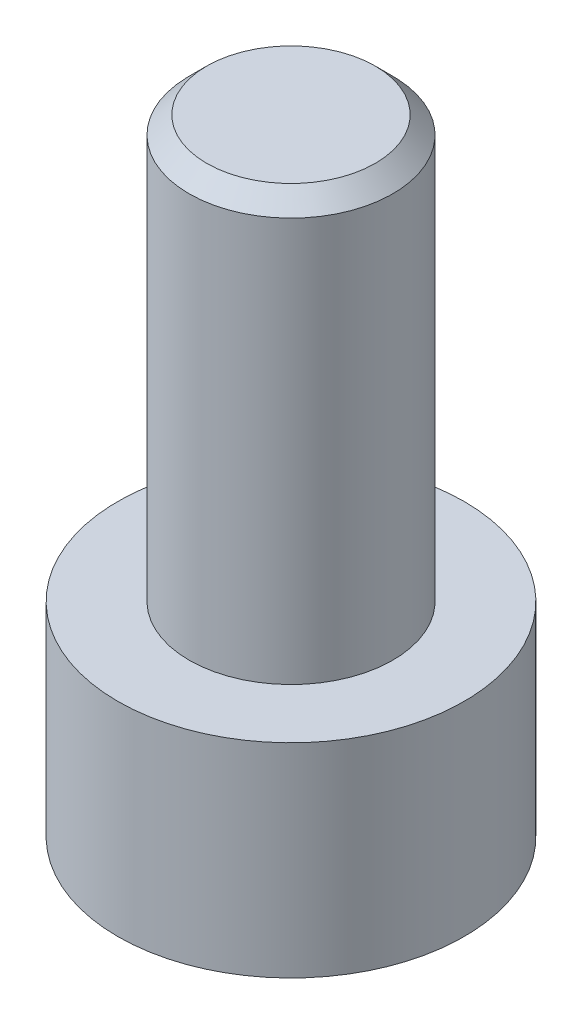
ISO-10303-21;
HEADER;
FILE_DESCRIPTION(('STEP AP214'),'2;1');
FILE_NAME('part.step','',(''),(''),'','','');
FILE_SCHEMA(('AUTOMOTIVE_DESIGN { 1 0 10303 214 1 1 1 1 }'));
ENDSEC;
DATA;
#1=APPLICATION_CONTEXT('core data for automotive mechanical design processes');
#2=APPLICATION_PROTOCOL_DEFINITION('international standard','automotive_design',2000,#1);
#3=PRODUCT_CONTEXT('',#1,'mechanical');
#4=PRODUCT('Part','Part','',(#3));
#5=PRODUCT_RELATED_PRODUCT_CATEGORY('part','',(#4));
#6=PRODUCT_DEFINITION_FORMATION('','',#4);
#7=PRODUCT_DEFINITION_CONTEXT('part definition',#1,'design');
#8=PRODUCT_DEFINITION('design','',#6,#7);
#9=PRODUCT_DEFINITION_SHAPE('','',#8);
#10=(LENGTH_UNIT() NAMED_UNIT(*) SI_UNIT(.MILLI.,.METRE.));
#11=(NAMED_UNIT(*) PLANE_ANGLE_UNIT() SI_UNIT($,.RADIAN.));
#12=(NAMED_UNIT(*) SI_UNIT($,.STERADIAN.) SOLID_ANGLE_UNIT());
#13=UNCERTAINTY_MEASURE_WITH_UNIT(LENGTH_MEASURE(1.E-05),#10,'distance_accuracy_value','');
#14=(GEOMETRIC_REPRESENTATION_CONTEXT(3) GLOBAL_UNCERTAINTY_ASSIGNED_CONTEXT((#13)) GLOBAL_UNIT_ASSIGNED_CONTEXT((#10,
#11,#12)) REPRESENTATION_CONTEXT('',''));
#15=CARTESIAN_POINT('',(0.,0.,0.));
#16=DIRECTION('',(0.,0.,1.));
#17=DIRECTION('',(1.,0.,0.));
#18=AXIS2_PLACEMENT_3D('',#15,#16,#17);
#19=CARTESIAN_POINT('',(0.,2.9,0.));
#20=DIRECTION('',(0.,-1.,0.));
#21=DIRECTION('',(0.,0.,-1.));
#22=AXIS2_PLACEMENT_3D('',#19,#20,#21);
#23=CYLINDRICAL_SURFACE('',#22,2.465);
#24=CARTESIAN_POINT('',(0.,2.9,0.));
#25=DIRECTION('',(0.,1.,0.));
#26=DIRECTION('',(0.,0.,1.));
#27=AXIS2_PLACEMENT_3D('',#24,#25,#26);
#28=CIRCLE('',#27,2.465);
#29=CARTESIAN_POINT('',(0.,2.9,2.465));
#30=VERTEX_POINT('',#29);
#31=EDGE_CURVE('E177',#30,#30,#28,.T.);
#32=ORIENTED_EDGE('',*,*,#31,.F.);
#33=EDGE_LOOP('',(#32));
#34=FACE_BOUND('',#33,.T.);
#35=CARTESIAN_POINT('',(0.,0.,0.));
#36=DIRECTION('',(0.,1.,0.));
#37=DIRECTION('',(0.,0.,1.));
#38=AXIS2_PLACEMENT_3D('',#35,#36,#37);
#39=CIRCLE('',#38,2.465);
#40=CARTESIAN_POINT('',(0.,0.,2.465));
#41=VERTEX_POINT('',#40);
#42=EDGE_CURVE('E163',#41,#41,#39,.T.);
#43=ORIENTED_EDGE('',*,*,#42,.T.);
#44=EDGE_LOOP('',(#43));
#45=FACE_BOUND('',#44,.T.);
#46=ADVANCED_FACE('F47',(#34,#45),#23,.T.);
#47=CARTESIAN_POINT('',(0.,2.9,0.));
#48=DIRECTION('',(0.,1.,0.));
#49=DIRECTION('',(0.,0.,1.));
#50=AXIS2_PLACEMENT_3D('',#47,#48,#49);
#51=PLANE('',#50);
#52=CARTESIAN_POINT('',(0.,2.9,0.));
#53=DIRECTION('',(0.,1.,0.));
#54=DIRECTION('',(0.,0.,1.));
#55=AXIS2_PLACEMENT_3D('',#52,#53,#54);
#56=CIRCLE('',#55,1.45);
#57=CARTESIAN_POINT('',(0.,2.9,1.45));
#58=VERTEX_POINT('',#57);
#59=EDGE_CURVE('E173',#58,#58,#56,.T.);
#60=ORIENTED_EDGE('',*,*,#59,.F.);
#61=EDGE_LOOP('',(#60));
#62=FACE_BOUND('',#61,.T.);
#63=ORIENTED_EDGE('',*,*,#31,.T.);
#64=EDGE_LOOP('',(#63));
#65=FACE_BOUND('',#64,.T.);
#66=ADVANCED_FACE('F199',(#62,#65),#51,.T.);
#67=CARTESIAN_POINT('',(0.,0.,0.));
#68=DIRECTION('',(0.,1.,0.));
#69=DIRECTION('',(0.,0.,1.));
#70=AXIS2_PLACEMENT_3D('',#67,#68,#69);
#71=PLANE('',#70);
#72=DIRECTION('',(0.5,0.,0.866025403784439));
#73=VECTOR('',#72,1.);
#74=CARTESIAN_POINT('',(0.733234841870825,0.,-1.27));
#75=LINE('',#74,#73);
#76=CARTESIAN_POINT('',(0.733234841870825,0.,-1.27));
#77=VERTEX_POINT('',#76);
#78=CARTESIAN_POINT('',(1.46646968374165,0.,0.));
#79=VERTEX_POINT('',#78);
#80=EDGE_CURVE('E144',#77,#79,#75,.T.);
#81=ORIENTED_EDGE('',*,*,#80,.F.);
#82=DIRECTION('',(1.,0.,0.));
#83=VECTOR('',#82,1.);
#84=CARTESIAN_POINT('',(-0.733234841870825,0.,-1.27));
#85=LINE('',#84,#83);
#86=CARTESIAN_POINT('',(-0.733234841870825,0.,-1.27));
#87=VERTEX_POINT('',#86);
#88=EDGE_CURVE('E64',#87,#77,#85,.T.);
#89=ORIENTED_EDGE('',*,*,#88,.F.);
#90=DIRECTION('',(0.5,0.,-0.866025403784438));
#91=VECTOR('',#90,1.);
#92=CARTESIAN_POINT('',(-1.46646968374165,0.,0.));
#93=LINE('',#92,#91);
#94=CARTESIAN_POINT('',(-1.46646968374165,0.,0.));
#95=VERTEX_POINT('',#94);
#96=EDGE_CURVE('E157',#95,#87,#93,.T.);
#97=ORIENTED_EDGE('',*,*,#96,.F.);
#98=DIRECTION('',(-0.5,0.,-0.866025403784439));
#99=VECTOR('',#98,1.);
#100=CARTESIAN_POINT('',(-0.733234841870825,0.,1.27));
#101=LINE('',#100,#99);
#102=CARTESIAN_POINT('',(-0.733234841870825,0.,1.27));
#103=VERTEX_POINT('',#102);
#104=EDGE_CURVE('E154',#103,#95,#101,.T.);
#105=ORIENTED_EDGE('',*,*,#104,.F.);
#106=DIRECTION('',(-1.,0.,0.));
#107=VECTOR('',#106,1.);
#108=CARTESIAN_POINT('',(0.733234841870825,0.,1.27));
#109=LINE('',#108,#107);
#110=CARTESIAN_POINT('',(0.733234841870825,0.,1.27));
#111=VERTEX_POINT('',#110);
#112=EDGE_CURVE('E112',#111,#103,#109,.T.);
#113=ORIENTED_EDGE('',*,*,#112,.F.);
#114=DIRECTION('',(-0.5,0.,0.866025403784439));
#115=VECTOR('',#114,1.);
#116=CARTESIAN_POINT('',(1.46646968374165,0.,0.));
#117=LINE('',#116,#115);
#118=EDGE_CURVE('E148',#79,#111,#117,.T.);
#119=ORIENTED_EDGE('',*,*,#118,.F.);
#120=EDGE_LOOP('',(#81,#89,#97,#105,#113,#119));
#121=FACE_BOUND('',#120,.T.);
#122=ORIENTED_EDGE('',*,*,#42,.F.);
#123=EDGE_LOOP('',(#122));
#124=FACE_BOUND('',#123,.T.);
#125=ADVANCED_FACE('F204',(#121,#124),#71,.F.);
#126=CARTESIAN_POINT('',(0.,8.9,0.));
#127=DIRECTION('',(0.,-1.,0.));
#128=DIRECTION('',(0.,0.,-1.));
#129=AXIS2_PLACEMENT_3D('',#126,#127,#128);
#130=CYLINDRICAL_SURFACE('',#129,1.45);
#131=CARTESIAN_POINT('',(0.,8.65,0.));
#132=DIRECTION('',(0.,1.,0.));
#133=DIRECTION('',(0.,0.,1.));
#134=AXIS2_PLACEMENT_3D('',#131,#132,#133);
#135=CIRCLE('',#134,1.45);
#136=CARTESIAN_POINT('',(0.,8.65,1.45));
#137=VERTEX_POINT('',#136);
#138=EDGE_CURVE('E11',#137,#137,#135,.F.);
#139=ORIENTED_EDGE('',*,*,#138,.T.);
#140=EDGE_LOOP('',(#139));
#141=FACE_BOUND('',#140,.T.);
#142=ORIENTED_EDGE('',*,*,#59,.T.);
#143=EDGE_LOOP('',(#142));
#144=FACE_BOUND('',#143,.T.);
#145=ADVANCED_FACE('F211',(#141,#144),#130,.T.);
#146=CARTESIAN_POINT('',(0.,8.9,0.));
#147=DIRECTION('',(0.,1.,0.));
#148=DIRECTION('',(0.,0.,1.));
#149=AXIS2_PLACEMENT_3D('',#146,#147,#148);
#150=PLANE('',#149);
#151=CARTESIAN_POINT('',(0.,8.9,0.));
#152=DIRECTION('',(0.,1.,0.));
#153=DIRECTION('',(0.,0.,1.));
#154=AXIS2_PLACEMENT_3D('',#151,#152,#153);
#155=CIRCLE('',#154,1.2);
#156=CARTESIAN_POINT('',(0.,8.9,1.2));
#157=VERTEX_POINT('',#156);
#158=EDGE_CURVE('E57',#157,#157,#155,.T.);
#159=ORIENTED_EDGE('',*,*,#158,.T.);
#160=EDGE_LOOP('',(#159));
#161=FACE_BOUND('',#160,.T.);
#162=ADVANCED_FACE('F187',(#161),#150,.T.);
#163=CARTESIAN_POINT('',(-0.733234841870825,1.9,-1.27));
#164=DIRECTION('',(0.,0.,-1.));
#165=DIRECTION('',(-1.,0.,0.));
#166=AXIS2_PLACEMENT_3D('',#163,#164,#165);
#167=PLANE('',#166);
#168=ORIENTED_EDGE('',*,*,#88,.T.);
#169=DIRECTION('',(0.,-1.,0.));
#170=VECTOR('',#169,1.);
#171=CARTESIAN_POINT('',(0.733234841870825,1.9,-1.27));
#172=LINE('',#171,#170);
#173=CARTESIAN_POINT('',(0.733234841870825,1.9,-1.27));
#174=VERTEX_POINT('',#173);
#175=EDGE_CURVE('E94',#174,#77,#172,.T.);
#176=ORIENTED_EDGE('',*,*,#175,.F.);
#177=DIRECTION('',(1.,0.,0.));
#178=VECTOR('',#177,1.);
#179=CARTESIAN_POINT('',(-0.733234841870825,1.9,-1.27));
#180=LINE('',#179,#178);
#181=CARTESIAN_POINT('',(-0.733234841870825,1.9,-1.27));
#182=VERTEX_POINT('',#181);
#183=EDGE_CURVE('E160',#182,#174,#180,.T.);
#184=ORIENTED_EDGE('',*,*,#183,.F.);
#185=DIRECTION('',(0.,-1.,0.));
#186=VECTOR('',#185,1.);
#187=CARTESIAN_POINT('',(-0.733234841870825,1.9,-1.27));
#188=LINE('',#187,#186);
#189=EDGE_CURVE('E72',#182,#87,#188,.T.);
#190=ORIENTED_EDGE('',*,*,#189,.T.);
#191=EDGE_LOOP('',(#168,#176,#184,#190));
#192=FACE_BOUND('',#191,.T.);
#193=ADVANCED_FACE('F218',(#192),#167,.F.);
#194=CARTESIAN_POINT('',(-1.46646968374165,1.9,0.));
#195=DIRECTION('',(-0.866025403784439,0.,-0.5));
#196=DIRECTION('',(-0.5,0.,0.866025403784439));
#197=AXIS2_PLACEMENT_3D('',#194,#195,#196);
#198=PLANE('',#197);
#199=ORIENTED_EDGE('',*,*,#96,.T.);
#200=ORIENTED_EDGE('',*,*,#189,.F.);
#201=DIRECTION('',(0.5,0.,-0.866025403784438));
#202=VECTOR('',#201,1.);
#203=CARTESIAN_POINT('',(-1.46646968374165,1.9,0.));
#204=LINE('',#203,#202);
#205=CARTESIAN_POINT('',(-1.46646968374165,1.9,0.));
#206=VERTEX_POINT('',#205);
#207=EDGE_CURVE('E126',#206,#182,#204,.T.);
#208=ORIENTED_EDGE('',*,*,#207,.F.);
#209=DIRECTION('',(0.,-1.,0.));
#210=VECTOR('',#209,1.);
#211=CARTESIAN_POINT('',(-1.46646968374165,1.9,0.));
#212=LINE('',#211,#210);
#213=EDGE_CURVE('E117',#206,#95,#212,.T.);
#214=ORIENTED_EDGE('',*,*,#213,.T.);
#215=EDGE_LOOP('',(#199,#200,#208,#214));
#216=FACE_BOUND('',#215,.T.);
#217=ADVANCED_FACE('F221',(#216),#198,.F.);
#218=CARTESIAN_POINT('',(-0.733234841870825,1.9,1.27));
#219=DIRECTION('',(-0.866025403784438,0.,0.5));
#220=DIRECTION('',(0.5,0.,0.866025403784439));
#221=AXIS2_PLACEMENT_3D('',#218,#219,#220);
#222=PLANE('',#221);
#223=ORIENTED_EDGE('',*,*,#104,.T.);
#224=ORIENTED_EDGE('',*,*,#213,.F.);
#225=DIRECTION('',(-0.5,0.,-0.866025403784439));
#226=VECTOR('',#225,1.);
#227=CARTESIAN_POINT('',(-0.733234841870825,1.9,1.27));
#228=LINE('',#227,#226);
#229=CARTESIAN_POINT('',(-0.733234841870825,1.9,1.27));
#230=VERTEX_POINT('',#229);
#231=EDGE_CURVE('E121',#230,#206,#228,.T.);
#232=ORIENTED_EDGE('',*,*,#231,.F.);
#233=DIRECTION('',(0.,-1.,0.));
#234=VECTOR('',#233,1.);
#235=CARTESIAN_POINT('',(-0.733234841870825,1.9,1.27));
#236=LINE('',#235,#234);
#237=EDGE_CURVE('E105',#230,#103,#236,.T.);
#238=ORIENTED_EDGE('',*,*,#237,.T.);
#239=EDGE_LOOP('',(#223,#224,#232,#238));
#240=FACE_BOUND('',#239,.T.);
#241=ADVANCED_FACE('F122',(#240),#222,.F.);
#242=CARTESIAN_POINT('',(0.733234841870825,1.9,1.27));
#243=DIRECTION('',(0.,0.,1.));
#244=DIRECTION('',(1.,0.,0.));
#245=AXIS2_PLACEMENT_3D('',#242,#243,#244);
#246=PLANE('',#245);
#247=ORIENTED_EDGE('',*,*,#112,.T.);
#248=ORIENTED_EDGE('',*,*,#237,.F.);
#249=DIRECTION('',(-1.,0.,0.));
#250=VECTOR('',#249,1.);
#251=CARTESIAN_POINT('',(0.733234841870825,1.9,1.27));
#252=LINE('',#251,#250);
#253=CARTESIAN_POINT('',(0.733234841870825,1.9,1.27));
#254=VERTEX_POINT('',#253);
#255=EDGE_CURVE('E109',#254,#230,#252,.T.);
#256=ORIENTED_EDGE('',*,*,#255,.F.);
#257=DIRECTION('',(0.,-1.,0.));
#258=VECTOR('',#257,1.);
#259=CARTESIAN_POINT('',(0.733234841870825,1.9,1.27));
#260=LINE('',#259,#258);
#261=EDGE_CURVE('E118',#254,#111,#260,.T.);
#262=ORIENTED_EDGE('',*,*,#261,.T.);
#263=EDGE_LOOP('',(#247,#248,#256,#262));
#264=FACE_BOUND('',#263,.T.);
#265=ADVANCED_FACE('F107',(#264),#246,.F.);
#266=CARTESIAN_POINT('',(1.46646968374165,1.9,0.));
#267=DIRECTION('',(0.866025403784438,0.,0.5));
#268=DIRECTION('',(0.5,0.,-0.866025403784439));
#269=AXIS2_PLACEMENT_3D('',#266,#267,#268);
#270=PLANE('',#269);
#271=ORIENTED_EDGE('',*,*,#118,.T.);
#272=ORIENTED_EDGE('',*,*,#261,.F.);
#273=DIRECTION('',(-0.5,0.,0.866025403784439));
#274=VECTOR('',#273,1.);
#275=CARTESIAN_POINT('',(1.46646968374165,1.9,0.));
#276=LINE('',#275,#274);
#277=CARTESIAN_POINT('',(1.46646968374165,1.9,0.));
#278=VERTEX_POINT('',#277);
#279=EDGE_CURVE('E132',#278,#254,#276,.T.);
#280=ORIENTED_EDGE('',*,*,#279,.F.);
#281=DIRECTION('',(0.,-1.,0.));
#282=VECTOR('',#281,1.);
#283=CARTESIAN_POINT('',(1.46646968374165,1.9,0.));
#284=LINE('',#283,#282);
#285=EDGE_CURVE('E168',#278,#79,#284,.T.);
#286=ORIENTED_EDGE('',*,*,#285,.T.);
#287=EDGE_LOOP('',(#271,#272,#280,#286));
#288=FACE_BOUND('',#287,.T.);
#289=ADVANCED_FACE('F224',(#288),#270,.F.);
#290=CARTESIAN_POINT('',(0.733234841870825,1.9,-1.27));
#291=DIRECTION('',(0.866025403784438,0.,-0.5));
#292=DIRECTION('',(-0.5,0.,-0.866025403784439));
#293=AXIS2_PLACEMENT_3D('',#290,#291,#292);
#294=PLANE('',#293);
#295=ORIENTED_EDGE('',*,*,#80,.T.);
#296=ORIENTED_EDGE('',*,*,#285,.F.);
#297=DIRECTION('',(0.5,0.,0.866025403784439));
#298=VECTOR('',#297,1.);
#299=CARTESIAN_POINT('',(0.733234841870825,1.9,-1.27));
#300=LINE('',#299,#298);
#301=EDGE_CURVE('E136',#174,#278,#300,.T.);
#302=ORIENTED_EDGE('',*,*,#301,.F.);
#303=ORIENTED_EDGE('',*,*,#175,.T.);
#304=EDGE_LOOP('',(#295,#296,#302,#303));
#305=FACE_BOUND('',#304,.T.);
#306=ADVANCED_FACE('F195',(#305),#294,.F.);
#307=CARTESIAN_POINT('',(0.,1.9,0.));
#308=DIRECTION('',(0.,-1.,0.));
#309=DIRECTION('',(0.,0.,-1.));
#310=AXIS2_PLACEMENT_3D('',#307,#308,#309);
#311=PLANE('',#310);
#312=ORIENTED_EDGE('',*,*,#183,.T.);
#313=ORIENTED_EDGE('',*,*,#301,.T.);
#314=ORIENTED_EDGE('',*,*,#279,.T.);
#315=ORIENTED_EDGE('',*,*,#255,.T.);
#316=ORIENTED_EDGE('',*,*,#231,.T.);
#317=ORIENTED_EDGE('',*,*,#207,.T.);
#318=EDGE_LOOP('',(#312,#313,#314,#315,#316,#317));
#319=FACE_BOUND('',#318,.T.);
#320=ADVANCED_FACE('F129',(#319),#311,.T.);
#321=CARTESIAN_POINT('',(0.,8.9,0.));
#322=DIRECTION('',(0.,-1.,0.));
#323=DIRECTION('',(0.,0.,-1.));
#324=AXIS2_PLACEMENT_3D('',#321,#322,#323);
#325=CONICAL_SURFACE('',#324,1.2,0.785398163397445);
#326=ORIENTED_EDGE('',*,*,#138,.F.);
#327=EDGE_LOOP('',(#326));
#328=FACE_BOUND('',#327,.T.);
#329=ORIENTED_EDGE('',*,*,#158,.F.);
#330=EDGE_LOOP('',(#329));
#331=FACE_BOUND('',#330,.T.);
#332=ADVANCED_FACE('F50',(#328,#331),#325,.T.);
#333=CLOSED_SHELL('',(#46,#66,#125,#145,#162,#193,#217,#241,#265,#289,#306,#320,#332));
#334=MANIFOLD_SOLID_BREP('B2',#333);
#335=ADVANCED_BREP_SHAPE_REPRESENTATION('',(#18,#334),#14);
#336=SHAPE_DEFINITION_REPRESENTATION(#9,#335);
ENDSEC;
END-ISO-10303-21;
